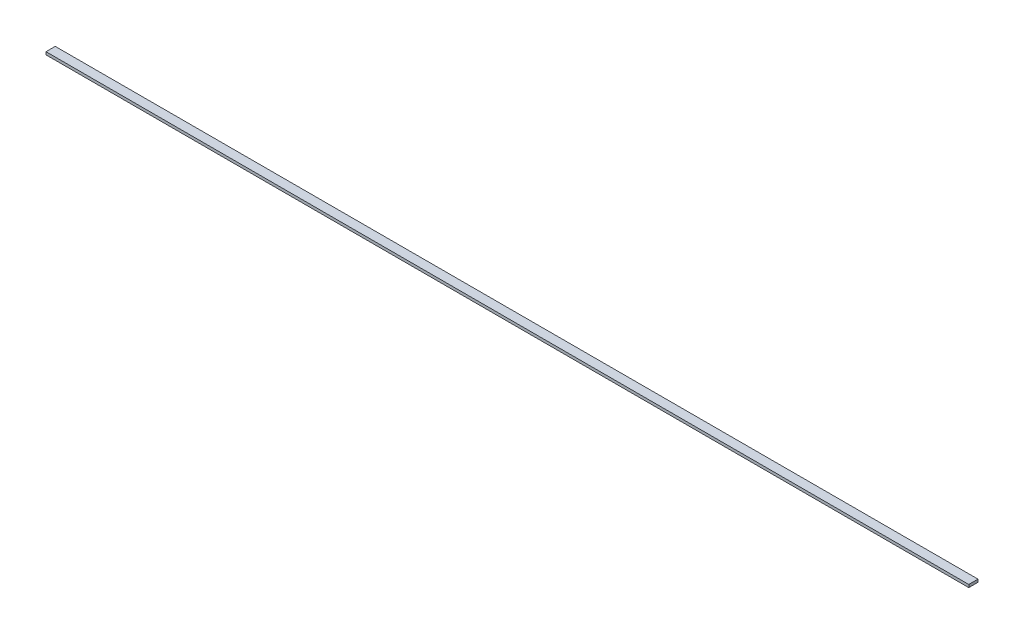
ISO-10303-21;
HEADER;
FILE_DESCRIPTION(('STEP AP214'),'2;1');
FILE_NAME('part.step','',(''),(''),'','','');
FILE_SCHEMA(('AUTOMOTIVE_DESIGN { 1 0 10303 214 1 1 1 1 }'));
ENDSEC;
DATA;
#1=APPLICATION_CONTEXT('core data for automotive mechanical design processes');
#2=APPLICATION_PROTOCOL_DEFINITION('international standard','automotive_design',2000,#1);
#3=PRODUCT_CONTEXT('',#1,'mechanical');
#4=PRODUCT('Part','Part','',(#3));
#5=PRODUCT_RELATED_PRODUCT_CATEGORY('part','',(#4));
#6=PRODUCT_DEFINITION_FORMATION('','',#4);
#7=PRODUCT_DEFINITION_CONTEXT('part definition',#1,'design');
#8=PRODUCT_DEFINITION('design','',#6,#7);
#9=PRODUCT_DEFINITION_SHAPE('','',#8);
#10=(LENGTH_UNIT() NAMED_UNIT(*) SI_UNIT(.MILLI.,.METRE.));
#11=(NAMED_UNIT(*) PLANE_ANGLE_UNIT() SI_UNIT($,.RADIAN.));
#12=(NAMED_UNIT(*) SI_UNIT($,.STERADIAN.) SOLID_ANGLE_UNIT());
#13=UNCERTAINTY_MEASURE_WITH_UNIT(LENGTH_MEASURE(1.E-05),#10,'distance_accuracy_value','');
#14=(GEOMETRIC_REPRESENTATION_CONTEXT(3) GLOBAL_UNCERTAINTY_ASSIGNED_CONTEXT((#13)) GLOBAL_UNIT_ASSIGNED_CONTEXT((#10,
#11,#12)) REPRESENTATION_CONTEXT('',''));
#15=CARTESIAN_POINT('',(0.,0.,0.));
#16=DIRECTION('',(0.,0.,1.));
#17=DIRECTION('',(1.,0.,0.));
#18=AXIS2_PLACEMENT_3D('',#15,#16,#17);
#19=CARTESIAN_POINT('',(0.,3.,0.));
#20=DIRECTION('',(1.,0.,0.));
#21=DIRECTION('',(0.,0.,-1.));
#22=AXIS2_PLACEMENT_3D('',#19,#20,#21);
#23=PLANE('',#22);
#24=DIRECTION('',(0.,0.,1.));
#25=VECTOR('',#24,1.);
#26=CARTESIAN_POINT('',(0.,0.,0.));
#27=LINE('',#26,#25);
#28=CARTESIAN_POINT('',(0.,0.,-10.));
#29=VERTEX_POINT('',#28);
#30=CARTESIAN_POINT('',(0.,0.,0.));
#31=VERTEX_POINT('',#30);
#32=EDGE_CURVE('E96',#29,#31,#27,.T.);
#33=ORIENTED_EDGE('',*,*,#32,.T.);
#34=DIRECTION('',(0.,-1.,0.));
#35=VECTOR('',#34,1.);
#36=CARTESIAN_POINT('',(0.,3.,0.));
#37=LINE('',#36,#35);
#38=CARTESIAN_POINT('',(0.,3.,0.));
#39=VERTEX_POINT('',#38);
#40=EDGE_CURVE('E11',#39,#31,#37,.T.);
#41=ORIENTED_EDGE('',*,*,#40,.F.);
#42=DIRECTION('',(0.,0.,1.));
#43=VECTOR('',#42,1.);
#44=CARTESIAN_POINT('',(0.,3.,0.));
#45=LINE('',#44,#43);
#46=CARTESIAN_POINT('',(0.,3.,-10.));
#47=VERTEX_POINT('',#46);
#48=EDGE_CURVE('E84',#47,#39,#45,.T.);
#49=ORIENTED_EDGE('',*,*,#48,.F.);
#50=DIRECTION('',(0.,-1.,0.));
#51=VECTOR('',#50,1.);
#52=CARTESIAN_POINT('',(0.,3.,-10.));
#53=LINE('',#52,#51);
#54=EDGE_CURVE('E92',#47,#29,#53,.T.);
#55=ORIENTED_EDGE('',*,*,#54,.T.);
#56=EDGE_LOOP('',(#33,#41,#49,#55));
#57=FACE_BOUND('',#56,.T.);
#58=ADVANCED_FACE('F33',(#57),#23,.F.);
#59=CARTESIAN_POINT('',(0.,3.,0.));
#60=DIRECTION('',(0.,0.,-1.));
#61=DIRECTION('',(-1.,0.,0.));
#62=AXIS2_PLACEMENT_3D('',#59,#60,#61);
#63=PLANE('',#62);
#64=DIRECTION('',(1.,0.,0.));
#65=VECTOR('',#64,1.);
#66=CARTESIAN_POINT('',(0.,0.,0.));
#67=LINE('',#66,#65);
#68=CARTESIAN_POINT('',(1000.,0.,0.));
#69=VERTEX_POINT('',#68);
#70=EDGE_CURVE('E88',#31,#69,#67,.T.);
#71=ORIENTED_EDGE('',*,*,#70,.T.);
#72=DIRECTION('',(0.,-1.,0.));
#73=VECTOR('',#72,1.);
#74=CARTESIAN_POINT('',(1000.,3.,0.));
#75=LINE('',#74,#73);
#76=CARTESIAN_POINT('',(1000.,3.,0.));
#77=VERTEX_POINT('',#76);
#78=EDGE_CURVE('E41',#77,#69,#75,.T.);
#79=ORIENTED_EDGE('',*,*,#78,.F.);
#80=DIRECTION('',(1.,0.,0.));
#81=VECTOR('',#80,1.);
#82=CARTESIAN_POINT('',(0.,3.,0.));
#83=LINE('',#82,#81);
#84=EDGE_CURVE('E79',#39,#77,#83,.T.);
#85=ORIENTED_EDGE('',*,*,#84,.F.);
#86=ORIENTED_EDGE('',*,*,#40,.T.);
#87=EDGE_LOOP('',(#71,#79,#85,#86));
#88=FACE_BOUND('',#87,.T.);
#89=ADVANCED_FACE('F87',(#88),#63,.F.);
#90=CARTESIAN_POINT('',(1000.,3.,-10.));
#91=DIRECTION('',(-1.,0.,0.));
#92=DIRECTION('',(0.,0.,1.));
#93=AXIS2_PLACEMENT_3D('',#90,#91,#92);
#94=PLANE('',#93);
#95=DIRECTION('',(0.,0.,-1.));
#96=VECTOR('',#95,1.);
#97=CARTESIAN_POINT('',(1000.,0.,-10.));
#98=LINE('',#97,#96);
#99=CARTESIAN_POINT('',(1000.,0.,-10.));
#100=VERTEX_POINT('',#99);
#101=EDGE_CURVE('E66',#69,#100,#98,.T.);
#102=ORIENTED_EDGE('',*,*,#101,.T.);
#103=DIRECTION('',(0.,-1.,0.));
#104=VECTOR('',#103,1.);
#105=CARTESIAN_POINT('',(1000.,3.,-10.));
#106=LINE('',#105,#104);
#107=CARTESIAN_POINT('',(1000.,3.,-10.));
#108=VERTEX_POINT('',#107);
#109=EDGE_CURVE('E89',#108,#100,#106,.T.);
#110=ORIENTED_EDGE('',*,*,#109,.F.);
#111=DIRECTION('',(0.,0.,-1.));
#112=VECTOR('',#111,1.);
#113=CARTESIAN_POINT('',(1000.,3.,-10.));
#114=LINE('',#113,#112);
#115=EDGE_CURVE('E82',#77,#108,#114,.T.);
#116=ORIENTED_EDGE('',*,*,#115,.F.);
#117=ORIENTED_EDGE('',*,*,#78,.T.);
#118=EDGE_LOOP('',(#102,#110,#116,#117));
#119=FACE_BOUND('',#118,.T.);
#120=ADVANCED_FACE('F90',(#119),#94,.F.);
#121=CARTESIAN_POINT('',(0.,3.,-10.));
#122=DIRECTION('',(0.,0.,1.));
#123=DIRECTION('',(1.,0.,0.));
#124=AXIS2_PLACEMENT_3D('',#121,#122,#123);
#125=PLANE('',#124);
#126=DIRECTION('',(-1.,0.,0.));
#127=VECTOR('',#126,1.);
#128=CARTESIAN_POINT('',(0.,0.,-10.));
#129=LINE('',#128,#127);
#130=EDGE_CURVE('E72',#100,#29,#129,.T.);
#131=ORIENTED_EDGE('',*,*,#130,.T.);
#132=ORIENTED_EDGE('',*,*,#54,.F.);
#133=DIRECTION('',(-1.,0.,0.));
#134=VECTOR('',#133,1.);
#135=CARTESIAN_POINT('',(0.,3.,-10.));
#136=LINE('',#135,#134);
#137=EDGE_CURVE('E49',#108,#47,#136,.T.);
#138=ORIENTED_EDGE('',*,*,#137,.F.);
#139=ORIENTED_EDGE('',*,*,#109,.T.);
#140=EDGE_LOOP('',(#131,#132,#138,#139));
#141=FACE_BOUND('',#140,.T.);
#142=ADVANCED_FACE('F103',(#141),#125,.F.);
#143=CARTESIAN_POINT('',(0.,3.,0.));
#144=DIRECTION('',(0.,-1.,0.));
#145=DIRECTION('',(0.,0.,-1.));
#146=AXIS2_PLACEMENT_3D('',#143,#144,#145);
#147=PLANE('',#146);
#148=ORIENTED_EDGE('',*,*,#48,.T.);
#149=ORIENTED_EDGE('',*,*,#84,.T.);
#150=ORIENTED_EDGE('',*,*,#115,.T.);
#151=ORIENTED_EDGE('',*,*,#137,.T.);
#152=EDGE_LOOP('',(#148,#149,#150,#151));
#153=FACE_BOUND('',#152,.T.);
#154=ADVANCED_FACE('F80',(#153),#147,.F.);
#155=CARTESIAN_POINT('',(0.,0.,0.));
#156=DIRECTION('',(0.,-1.,0.));
#157=DIRECTION('',(0.,0.,-1.));
#158=AXIS2_PLACEMENT_3D('',#155,#156,#157);
#159=PLANE('',#158);
#160=ORIENTED_EDGE('',*,*,#32,.F.);
#161=ORIENTED_EDGE('',*,*,#130,.F.);
#162=ORIENTED_EDGE('',*,*,#101,.F.);
#163=ORIENTED_EDGE('',*,*,#70,.F.);
#164=EDGE_LOOP('',(#160,#161,#162,#163));
#165=FACE_BOUND('',#164,.T.);
#166=ADVANCED_FACE('F106',(#165),#159,.T.);
#167=CLOSED_SHELL('',(#58,#89,#120,#142,#154,#166));
#168=MANIFOLD_SOLID_BREP('B2',#167);
#169=ADVANCED_BREP_SHAPE_REPRESENTATION('',(#18,#168),#14);
#170=SHAPE_DEFINITION_REPRESENTATION(#9,#169);
ENDSEC;
END-ISO-10303-21;
